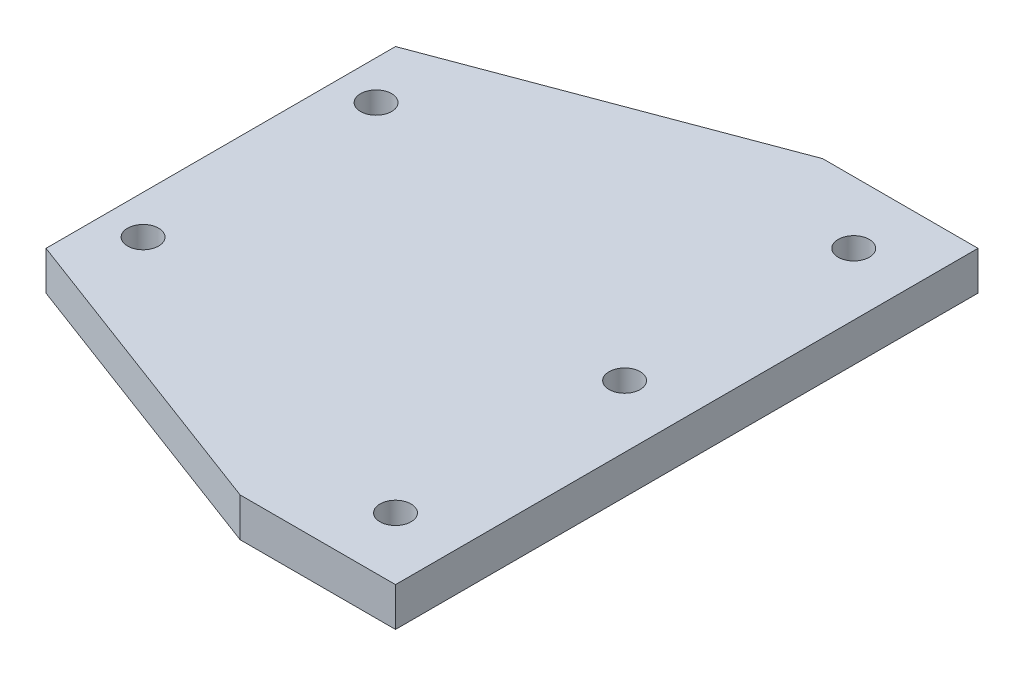
ISO-10303-21;
HEADER;
FILE_DESCRIPTION(('STEP AP214'),'2;1');
FILE_NAME('part.step','',(''),(''),'','','');
FILE_SCHEMA(('AUTOMOTIVE_DESIGN { 1 0 10303 214 1 1 1 1 }'));
ENDSEC;
DATA;
#1=APPLICATION_CONTEXT('core data for automotive mechanical design processes');
#2=APPLICATION_PROTOCOL_DEFINITION('international standard','automotive_design',2000,#1);
#3=PRODUCT_CONTEXT('',#1,'mechanical');
#4=PRODUCT('Part','Part','',(#3));
#5=PRODUCT_RELATED_PRODUCT_CATEGORY('part','',(#4));
#6=PRODUCT_DEFINITION_FORMATION('','',#4);
#7=PRODUCT_DEFINITION_CONTEXT('part definition',#1,'design');
#8=PRODUCT_DEFINITION('design','',#6,#7);
#9=PRODUCT_DEFINITION_SHAPE('','',#8);
#10=(LENGTH_UNIT() NAMED_UNIT(*) SI_UNIT(.MILLI.,.METRE.));
#11=(NAMED_UNIT(*) PLANE_ANGLE_UNIT() SI_UNIT($,.RADIAN.));
#12=(NAMED_UNIT(*) SI_UNIT($,.STERADIAN.) SOLID_ANGLE_UNIT());
#13=UNCERTAINTY_MEASURE_WITH_UNIT(LENGTH_MEASURE(1.E-05),#10,'distance_accuracy_value','');
#14=(GEOMETRIC_REPRESENTATION_CONTEXT(3) GLOBAL_UNCERTAINTY_ASSIGNED_CONTEXT((#13)) GLOBAL_UNIT_ASSIGNED_CONTEXT((#10,
#11,#12)) REPRESENTATION_CONTEXT('',''));
#15=CARTESIAN_POINT('',(0.,0.,0.));
#16=DIRECTION('',(0.,0.,1.));
#17=DIRECTION('',(1.,0.,0.));
#18=AXIS2_PLACEMENT_3D('',#15,#16,#17);
#19=CARTESIAN_POINT('',(-423.197970491387,42.5,487.5));
#20=DIRECTION('',(1.,0.,0.));
#21=DIRECTION('',(0.,0.,-1.));
#22=AXIS2_PLACEMENT_3D('',#19,#20,#21);
#23=PLANE('',#22);
#24=DIRECTION('',(0.,0.,1.));
#25=VECTOR('',#24,1.);
#26=CARTESIAN_POINT('',(-423.197970491387,42.5,487.5));
#27=LINE('',#26,#25);
#28=CARTESIAN_POINT('',(-423.197970491387,42.5,-412.499999999999));
#29=VERTEX_POINT('',#28);
#30=CARTESIAN_POINT('',(-423.197970491387,42.5,262.5));
#31=VERTEX_POINT('',#30);
#32=EDGE_CURVE('E108',#29,#31,#27,.T.);
#33=ORIENTED_EDGE('',*,*,#32,.F.);
#34=DIRECTION('',(0.,-1.,0.));
#35=VECTOR('',#34,1.);
#36=CARTESIAN_POINT('',(-423.197970491387,42.5,-412.499999999999));
#37=LINE('',#36,#35);
#38=CARTESIAN_POINT('',(-423.197970491387,-32.5,-412.499999999999));
#39=VERTEX_POINT('',#38);
#40=EDGE_CURVE('E156',#29,#39,#37,.T.);
#41=ORIENTED_EDGE('',*,*,#40,.T.);
#42=DIRECTION('',(0.,0.,1.));
#43=VECTOR('',#42,1.);
#44=CARTESIAN_POINT('',(-423.197970491387,-32.5,487.5));
#45=LINE('',#44,#43);
#46=CARTESIAN_POINT('',(-423.197970491387,-32.5,262.5));
#47=VERTEX_POINT('',#46);
#48=EDGE_CURVE('E130',#39,#47,#45,.T.);
#49=ORIENTED_EDGE('',*,*,#48,.T.);
#50=DIRECTION('',(0.,1.,0.));
#51=VECTOR('',#50,1.);
#52=CARTESIAN_POINT('',(-423.197970491387,42.5,262.5));
#53=LINE('',#52,#51);
#54=EDGE_CURVE('E150',#47,#31,#53,.T.);
#55=ORIENTED_EDGE('',*,*,#54,.T.);
#56=EDGE_LOOP('',(#33,#41,#49,#55));
#57=FACE_BOUND('',#56,.T.);
#58=ADVANCED_FACE('F43',(#57),#23,.F.);
#59=CARTESIAN_POINT('',(-423.197970491387,42.5,487.5));
#60=DIRECTION('',(0.,0.,-1.));
#61=DIRECTION('',(-1.,0.,0.));
#62=AXIS2_PLACEMENT_3D('',#59,#60,#61);
#63=PLANE('',#62);
#64=DIRECTION('',(1.,0.,0.));
#65=VECTOR('',#64,1.);
#66=CARTESIAN_POINT('',(-423.197970491387,42.5,487.5));
#67=LINE('',#66,#65);
#68=CARTESIAN_POINT('',(176.802029508619,42.5,487.5));
#69=VERTEX_POINT('',#68);
#70=CARTESIAN_POINT('',(476.802029508613,42.5,487.5));
#71=VERTEX_POINT('',#70);
#72=EDGE_CURVE('E96',#69,#71,#67,.T.);
#73=ORIENTED_EDGE('',*,*,#72,.F.);
#74=DIRECTION('',(0.,-1.,0.));
#75=VECTOR('',#74,1.);
#76=CARTESIAN_POINT('',(176.802029508619,42.5,487.5));
#77=LINE('',#76,#75);
#78=CARTESIAN_POINT('',(176.802029508619,-32.5,487.5));
#79=VERTEX_POINT('',#78);
#80=EDGE_CURVE('E118',#69,#79,#77,.T.);
#81=ORIENTED_EDGE('',*,*,#80,.T.);
#82=DIRECTION('',(1.,0.,0.));
#83=VECTOR('',#82,1.);
#84=CARTESIAN_POINT('',(-423.197970491387,-32.5,487.5));
#85=LINE('',#84,#83);
#86=CARTESIAN_POINT('',(476.802029508613,-32.5,487.5));
#87=VERTEX_POINT('',#86);
#88=EDGE_CURVE('E114',#79,#87,#85,.T.);
#89=ORIENTED_EDGE('',*,*,#88,.T.);
#90=DIRECTION('',(0.,-1.,0.));
#91=VECTOR('',#90,1.);
#92=CARTESIAN_POINT('',(476.802029508613,42.5,487.5));
#93=LINE('',#92,#91);
#94=EDGE_CURVE('E111',#71,#87,#93,.T.);
#95=ORIENTED_EDGE('',*,*,#94,.F.);
#96=EDGE_LOOP('',(#73,#81,#89,#95));
#97=FACE_BOUND('',#96,.T.);
#98=ADVANCED_FACE('F112',(#97),#63,.F.);
#99=CARTESIAN_POINT('',(476.802029508613,42.5,487.5));
#100=DIRECTION('',(-1.,0.,0.));
#101=DIRECTION('',(0.,0.,1.));
#102=AXIS2_PLACEMENT_3D('',#99,#100,#101);
#103=PLANE('',#102);
#104=DIRECTION('',(0.,0.,-1.));
#105=VECTOR('',#104,1.);
#106=CARTESIAN_POINT('',(476.802029508613,-32.5,487.5));
#107=LINE('',#106,#105);
#108=CARTESIAN_POINT('',(476.802029508613,-32.5,-637.5));
#109=VERTEX_POINT('',#108);
#110=EDGE_CURVE('E136',#87,#109,#107,.T.);
#111=ORIENTED_EDGE('',*,*,#110,.T.);
#112=DIRECTION('',(0.,-1.,0.));
#113=VECTOR('',#112,1.);
#114=CARTESIAN_POINT('',(476.802029508613,42.5,-637.5));
#115=LINE('',#114,#113);
#116=CARTESIAN_POINT('',(476.802029508613,42.5,-637.5));
#117=VERTEX_POINT('',#116);
#118=EDGE_CURVE('E119',#117,#109,#115,.T.);
#119=ORIENTED_EDGE('',*,*,#118,.F.);
#120=DIRECTION('',(0.,0.,-1.));
#121=VECTOR('',#120,1.);
#122=CARTESIAN_POINT('',(476.802029508613,42.5,487.5));
#123=LINE('',#122,#121);
#124=EDGE_CURVE('E100',#71,#117,#123,.T.);
#125=ORIENTED_EDGE('',*,*,#124,.F.);
#126=ORIENTED_EDGE('',*,*,#94,.T.);
#127=EDGE_LOOP('',(#111,#119,#125,#126));
#128=FACE_BOUND('',#127,.T.);
#129=ADVANCED_FACE('F121',(#128),#103,.F.);
#130=CARTESIAN_POINT('',(-423.197970491387,42.5,-637.5));
#131=DIRECTION('',(0.,0.,1.));
#132=DIRECTION('',(1.,0.,0.));
#133=AXIS2_PLACEMENT_3D('',#130,#131,#132);
#134=PLANE('',#133);
#135=DIRECTION('',(-1.,0.,0.));
#136=VECTOR('',#135,1.);
#137=CARTESIAN_POINT('',(-423.197970491387,-32.5,-637.5));
#138=LINE('',#137,#136);
#139=CARTESIAN_POINT('',(176.802029508618,-32.5,-637.5));
#140=VERTEX_POINT('',#139);
#141=EDGE_CURVE('E139',#109,#140,#138,.T.);
#142=ORIENTED_EDGE('',*,*,#141,.T.);
#143=DIRECTION('',(0.,1.,0.));
#144=VECTOR('',#143,1.);
#145=CARTESIAN_POINT('',(176.802029508618,42.5,-637.5));
#146=LINE('',#145,#144);
#147=CARTESIAN_POINT('',(176.802029508618,42.5,-637.5));
#148=VERTEX_POINT('',#147);
#149=EDGE_CURVE('E52',#140,#148,#146,.T.);
#150=ORIENTED_EDGE('',*,*,#149,.T.);
#151=DIRECTION('',(-1.,0.,0.));
#152=VECTOR('',#151,1.);
#153=CARTESIAN_POINT('',(-423.197970491387,42.5,-637.5));
#154=LINE('',#153,#152);
#155=EDGE_CURVE('E124',#117,#148,#154,.T.);
#156=ORIENTED_EDGE('',*,*,#155,.F.);
#157=ORIENTED_EDGE('',*,*,#118,.T.);
#158=EDGE_LOOP('',(#142,#150,#156,#157));
#159=FACE_BOUND('',#158,.T.);
#160=ADVANCED_FACE('F188',(#159),#134,.F.);
#161=CARTESIAN_POINT('',(-423.197970491387,42.5,487.5));
#162=DIRECTION('',(0.,-1.,0.));
#163=DIRECTION('',(0.,0.,-1.));
#164=AXIS2_PLACEMENT_3D('',#161,#162,#163);
#165=PLANE('',#164);
#166=CARTESIAN_POINT('',(356.802029508613,42.5,-75.));
#167=DIRECTION('',(0.,1.,0.));
#168=DIRECTION('',(0.,0.,1.));
#169=AXIS2_PLACEMENT_3D('',#166,#167,#168);
#170=CIRCLE('',#169,30.);
#171=CARTESIAN_POINT('',(356.802029508613,42.5,-45.));
#172=VERTEX_POINT('',#171);
#173=EDGE_CURVE('E220',#172,#172,#170,.T.);
#174=ORIENTED_EDGE('',*,*,#173,.F.);
#175=EDGE_LOOP('',(#174));
#176=FACE_BOUND('',#175,.T.);
#177=CARTESIAN_POINT('',(-348.197970491387,42.5,150.));
#178=DIRECTION('',(0.,1.,0.));
#179=DIRECTION('',(0.,0.,1.));
#180=AXIS2_PLACEMENT_3D('',#177,#178,#179);
#181=CIRCLE('',#180,30.);
#182=CARTESIAN_POINT('',(-348.197970491387,42.5,180.));
#183=VERTEX_POINT('',#182);
#184=EDGE_CURVE('E224',#183,#183,#181,.T.);
#185=ORIENTED_EDGE('',*,*,#184,.F.);
#186=EDGE_LOOP('',(#185));
#187=FACE_BOUND('',#186,.T.);
#188=CARTESIAN_POINT('',(-348.197970491387,42.5,-300.));
#189=DIRECTION('',(0.,1.,0.));
#190=DIRECTION('',(0.,0.,1.));
#191=AXIS2_PLACEMENT_3D('',#188,#189,#190);
#192=CIRCLE('',#191,30.);
#193=CARTESIAN_POINT('',(-348.197970491387,42.5,-270.));
#194=VERTEX_POINT('',#193);
#195=EDGE_CURVE('E231',#194,#194,#192,.T.);
#196=ORIENTED_EDGE('',*,*,#195,.F.);
#197=EDGE_LOOP('',(#196));
#198=FACE_BOUND('',#197,.T.);
#199=CARTESIAN_POINT('',(356.802029508613,42.5,367.5));
#200=DIRECTION('',(0.,1.,0.));
#201=DIRECTION('',(0.,0.,1.));
#202=AXIS2_PLACEMENT_3D('',#199,#200,#201);
#203=CIRCLE('',#202,29.9999999999999);
#204=CARTESIAN_POINT('',(356.802029508613,42.5,397.5));
#205=VERTEX_POINT('',#204);
#206=EDGE_CURVE('E239',#205,#205,#203,.T.);
#207=ORIENTED_EDGE('',*,*,#206,.F.);
#208=EDGE_LOOP('',(#207));
#209=FACE_BOUND('',#208,.T.);
#210=CARTESIAN_POINT('',(356.802029508613,42.5,-517.5));
#211=DIRECTION('',(0.,1.,0.));
#212=DIRECTION('',(0.,0.,1.));
#213=AXIS2_PLACEMENT_3D('',#210,#211,#212);
#214=CIRCLE('',#213,30.);
#215=CARTESIAN_POINT('',(356.802029508613,42.5,-487.5));
#216=VERTEX_POINT('',#215);
#217=EDGE_CURVE('E247',#216,#216,#214,.T.);
#218=ORIENTED_EDGE('',*,*,#217,.F.);
#219=EDGE_LOOP('',(#218));
#220=FACE_BOUND('',#219,.T.);
#221=ORIENTED_EDGE('',*,*,#155,.T.);
#222=DIRECTION('',(0.936329177569046,0.,-0.351123441588389));
#223=VECTOR('',#222,1.);
#224=CARTESIAN_POINT('',(-423.197970491387,42.5,-412.499999999999));
#225=LINE('',#224,#223);
#226=EDGE_CURVE('E11',#148,#29,#225,.F.);
#227=ORIENTED_EDGE('',*,*,#226,.T.);
#228=ORIENTED_EDGE('',*,*,#32,.T.);
#229=DIRECTION('',(-0.936329177569046,0.,-0.351123441588389));
#230=VECTOR('',#229,1.);
#231=CARTESIAN_POINT('',(176.802029508619,42.5,487.5));
#232=LINE('',#231,#230);
#233=EDGE_CURVE('E103',#31,#69,#232,.F.);
#234=ORIENTED_EDGE('',*,*,#233,.T.);
#235=ORIENTED_EDGE('',*,*,#72,.T.);
#236=ORIENTED_EDGE('',*,*,#124,.T.);
#237=EDGE_LOOP('',(#221,#227,#228,#234,#235,#236));
#238=FACE_BOUND('',#237,.T.);
#239=ADVANCED_FACE('F98',(#176,#187,#198,#209,#220,#238),#165,.F.);
#240=CARTESIAN_POINT('',(-423.197970491387,-32.5,487.5));
#241=DIRECTION('',(0.,-1.,0.));
#242=DIRECTION('',(0.,0.,-1.));
#243=AXIS2_PLACEMENT_3D('',#240,#241,#242);
#244=PLANE('',#243);
#245=CARTESIAN_POINT('',(356.802029508613,-32.5,-75.));
#246=DIRECTION('',(0.,1.,0.));
#247=DIRECTION('',(0.,0.,1.));
#248=AXIS2_PLACEMENT_3D('',#245,#246,#247);
#249=CIRCLE('',#248,30.);
#250=CARTESIAN_POINT('',(356.802029508613,-32.5,-45.));
#251=VERTEX_POINT('',#250);
#252=EDGE_CURVE('E217',#251,#251,#249,.T.);
#253=ORIENTED_EDGE('',*,*,#252,.T.);
#254=EDGE_LOOP('',(#253));
#255=FACE_BOUND('',#254,.T.);
#256=CARTESIAN_POINT('',(-348.197970491387,-32.5,150.));
#257=DIRECTION('',(0.,1.,0.));
#258=DIRECTION('',(0.,0.,1.));
#259=AXIS2_PLACEMENT_3D('',#256,#257,#258);
#260=CIRCLE('',#259,30.);
#261=CARTESIAN_POINT('',(-348.197970491387,-32.5,180.));
#262=VERTEX_POINT('',#261);
#263=EDGE_CURVE('E227',#262,#262,#260,.T.);
#264=ORIENTED_EDGE('',*,*,#263,.T.);
#265=EDGE_LOOP('',(#264));
#266=FACE_BOUND('',#265,.T.);
#267=CARTESIAN_POINT('',(-348.197970491387,-32.5,-300.));
#268=DIRECTION('',(0.,1.,0.));
#269=DIRECTION('',(0.,0.,1.));
#270=AXIS2_PLACEMENT_3D('',#267,#268,#269);
#271=CIRCLE('',#270,30.);
#272=CARTESIAN_POINT('',(-348.197970491387,-32.5,-270.));
#273=VERTEX_POINT('',#272);
#274=EDGE_CURVE('E235',#273,#273,#271,.T.);
#275=ORIENTED_EDGE('',*,*,#274,.T.);
#276=EDGE_LOOP('',(#275));
#277=FACE_BOUND('',#276,.T.);
#278=CARTESIAN_POINT('',(356.802029508613,-32.5,367.5));
#279=DIRECTION('',(0.,1.,0.));
#280=DIRECTION('',(0.,0.,1.));
#281=AXIS2_PLACEMENT_3D('',#278,#279,#280);
#282=CIRCLE('',#281,29.9999999999999);
#283=CARTESIAN_POINT('',(356.802029508613,-32.5,397.5));
#284=VERTEX_POINT('',#283);
#285=EDGE_CURVE('E243',#284,#284,#282,.T.);
#286=ORIENTED_EDGE('',*,*,#285,.T.);
#287=EDGE_LOOP('',(#286));
#288=FACE_BOUND('',#287,.T.);
#289=CARTESIAN_POINT('',(356.802029508613,-32.5,-517.5));
#290=DIRECTION('',(0.,1.,0.));
#291=DIRECTION('',(0.,0.,1.));
#292=AXIS2_PLACEMENT_3D('',#289,#290,#291);
#293=CIRCLE('',#292,30.);
#294=CARTESIAN_POINT('',(356.802029508613,-32.5,-487.5));
#295=VERTEX_POINT('',#294);
#296=EDGE_CURVE('E133',#295,#295,#293,.T.);
#297=ORIENTED_EDGE('',*,*,#296,.T.);
#298=EDGE_LOOP('',(#297));
#299=FACE_BOUND('',#298,.T.);
#300=ORIENTED_EDGE('',*,*,#48,.F.);
#301=DIRECTION('',(-0.936329177569046,0.,0.351123441588389));
#302=VECTOR('',#301,1.);
#303=CARTESIAN_POINT('',(-719.088381450289,-32.5,-301.541095890412));
#304=LINE('',#303,#302);
#305=EDGE_CURVE('E66',#39,#140,#304,.F.);
#306=ORIENTED_EDGE('',*,*,#305,.T.);
#307=ORIENTED_EDGE('',*,*,#141,.F.);
#308=ORIENTED_EDGE('',*,*,#110,.F.);
#309=ORIENTED_EDGE('',*,*,#88,.F.);
#310=DIRECTION('',(0.936329177569046,0.,0.351123441588389));
#311=VECTOR('',#310,1.);
#312=CARTESIAN_POINT('',(-349.225367751662,-32.5,290.239726027397));
#313=LINE('',#312,#311);
#314=EDGE_CURVE('E146',#79,#47,#313,.F.);
#315=ORIENTED_EDGE('',*,*,#314,.T.);
#316=EDGE_LOOP('',(#300,#306,#307,#308,#309,#315));
#317=FACE_BOUND('',#316,.T.);
#318=ADVANCED_FACE('F167',(#255,#266,#277,#288,#299,#317),#244,.T.);
#319=CARTESIAN_POINT('',(176.802029508619,42.5,487.5));
#320=DIRECTION('',(0.351123441588389,0.,-0.936329177569046));
#321=DIRECTION('',(0.,-1.,0.));
#322=AXIS2_PLACEMENT_3D('',#319,#320,#321);
#323=PLANE('',#322);
#324=ORIENTED_EDGE('',*,*,#233,.F.);
#325=ORIENTED_EDGE('',*,*,#54,.F.);
#326=ORIENTED_EDGE('',*,*,#314,.F.);
#327=ORIENTED_EDGE('',*,*,#80,.F.);
#328=EDGE_LOOP('',(#324,#325,#326,#327));
#329=FACE_BOUND('',#328,.T.);
#330=ADVANCED_FACE('F170',(#329),#323,.F.);
#331=CARTESIAN_POINT('',(-423.197970491387,42.5,-412.499999999999));
#332=DIRECTION('',(0.351123441588389,0.,0.936329177569045));
#333=DIRECTION('',(0.,-1.,0.));
#334=AXIS2_PLACEMENT_3D('',#331,#332,#333);
#335=PLANE('',#334);
#336=ORIENTED_EDGE('',*,*,#226,.F.);
#337=ORIENTED_EDGE('',*,*,#149,.F.);
#338=ORIENTED_EDGE('',*,*,#305,.F.);
#339=ORIENTED_EDGE('',*,*,#40,.F.);
#340=EDGE_LOOP('',(#336,#337,#338,#339));
#341=FACE_BOUND('',#340,.T.);
#342=ADVANCED_FACE('F45',(#341),#335,.F.);
#343=CARTESIAN_POINT('',(356.802029508613,-32.5,-517.5));
#344=DIRECTION('',(0.,1.,0.));
#345=DIRECTION('',(0.,0.,1.));
#346=AXIS2_PLACEMENT_3D('',#343,#344,#345);
#347=CYLINDRICAL_SURFACE('',#346,30.);
#348=ORIENTED_EDGE('',*,*,#296,.F.);
#349=EDGE_LOOP('',(#348));
#350=FACE_BOUND('',#349,.T.);
#351=ORIENTED_EDGE('',*,*,#217,.T.);
#352=EDGE_LOOP('',(#351));
#353=FACE_BOUND('',#352,.T.);
#354=ADVANCED_FACE('F176',(#350,#353),#347,.F.);
#355=CARTESIAN_POINT('',(356.802029508613,-32.5,367.5));
#356=DIRECTION('',(0.,1.,0.));
#357=DIRECTION('',(0.,0.,1.));
#358=AXIS2_PLACEMENT_3D('',#355,#356,#357);
#359=CYLINDRICAL_SURFACE('',#358,29.9999999999999);
#360=ORIENTED_EDGE('',*,*,#285,.F.);
#361=EDGE_LOOP('',(#360));
#362=FACE_BOUND('',#361,.T.);
#363=ORIENTED_EDGE('',*,*,#206,.T.);
#364=EDGE_LOOP('',(#363));
#365=FACE_BOUND('',#364,.T.);
#366=ADVANCED_FACE('F196',(#362,#365),#359,.F.);
#367=CARTESIAN_POINT('',(-348.197970491387,-32.5,-300.));
#368=DIRECTION('',(0.,1.,0.));
#369=DIRECTION('',(0.,0.,1.));
#370=AXIS2_PLACEMENT_3D('',#367,#368,#369);
#371=CYLINDRICAL_SURFACE('',#370,30.);
#372=ORIENTED_EDGE('',*,*,#274,.F.);
#373=EDGE_LOOP('',(#372));
#374=FACE_BOUND('',#373,.T.);
#375=ORIENTED_EDGE('',*,*,#195,.T.);
#376=EDGE_LOOP('',(#375));
#377=FACE_BOUND('',#376,.T.);
#378=ADVANCED_FACE('F200',(#374,#377),#371,.F.);
#379=CARTESIAN_POINT('',(-348.197970491387,-32.5,150.));
#380=DIRECTION('',(0.,1.,0.));
#381=DIRECTION('',(0.,0.,1.));
#382=AXIS2_PLACEMENT_3D('',#379,#380,#381);
#383=CYLINDRICAL_SURFACE('',#382,30.);
#384=ORIENTED_EDGE('',*,*,#263,.F.);
#385=EDGE_LOOP('',(#384));
#386=FACE_BOUND('',#385,.T.);
#387=ORIENTED_EDGE('',*,*,#184,.T.);
#388=EDGE_LOOP('',(#387));
#389=FACE_BOUND('',#388,.T.);
#390=ADVANCED_FACE('F204',(#386,#389),#383,.F.);
#391=CARTESIAN_POINT('',(356.802029508613,-32.5,-75.));
#392=DIRECTION('',(0.,1.,0.));
#393=DIRECTION('',(0.,0.,1.));
#394=AXIS2_PLACEMENT_3D('',#391,#392,#393);
#395=CYLINDRICAL_SURFACE('',#394,30.);
#396=ORIENTED_EDGE('',*,*,#252,.F.);
#397=EDGE_LOOP('',(#396));
#398=FACE_BOUND('',#397,.T.);
#399=ORIENTED_EDGE('',*,*,#173,.T.);
#400=EDGE_LOOP('',(#399));
#401=FACE_BOUND('',#400,.T.);
#402=ADVANCED_FACE('F208',(#398,#401),#395,.F.);
#403=CLOSED_SHELL('',(#58,#98,#129,#160,#239,#318,#330,#342,#354,#366,#378,#390,#402));
#404=MANIFOLD_SOLID_BREP('B2',#403);
#405=ADVANCED_BREP_SHAPE_REPRESENTATION('',(#18,#404),#14);
#406=SHAPE_DEFINITION_REPRESENTATION(#9,#405);
ENDSEC;
END-ISO-10303-21;
